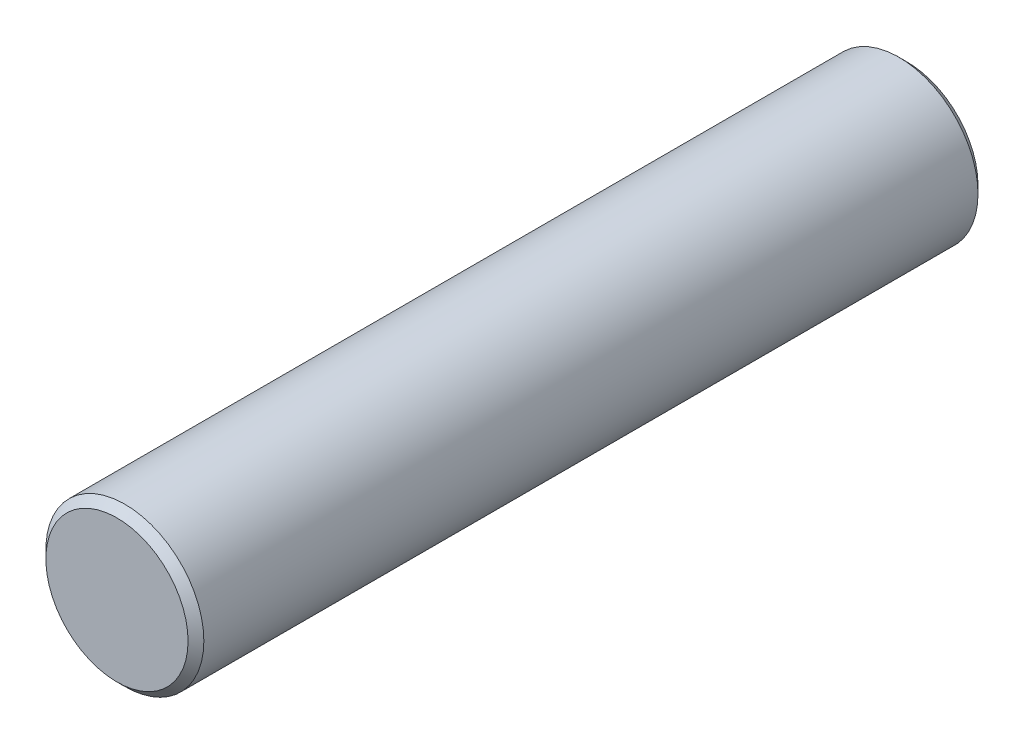
ISO-10303-21;
HEADER;
FILE_DESCRIPTION(('STEP AP214'),'2;1');
FILE_NAME('part.step','',(''),(''),'','','');
FILE_SCHEMA(('AUTOMOTIVE_DESIGN { 1 0 10303 214 1 1 1 1 }'));
ENDSEC;
DATA;
#1=APPLICATION_CONTEXT('core data for automotive mechanical design processes');
#2=APPLICATION_PROTOCOL_DEFINITION('international standard','automotive_design',2000,#1);
#3=PRODUCT_CONTEXT('',#1,'mechanical');
#4=PRODUCT('Part','Part','',(#3));
#5=PRODUCT_RELATED_PRODUCT_CATEGORY('part','',(#4));
#6=PRODUCT_DEFINITION_FORMATION('','',#4);
#7=PRODUCT_DEFINITION_CONTEXT('part definition',#1,'design');
#8=PRODUCT_DEFINITION('design','',#6,#7);
#9=PRODUCT_DEFINITION_SHAPE('','',#8);
#10=(LENGTH_UNIT() NAMED_UNIT(*) SI_UNIT(.MILLI.,.METRE.));
#11=(NAMED_UNIT(*) PLANE_ANGLE_UNIT() SI_UNIT($,.RADIAN.));
#12=(NAMED_UNIT(*) SI_UNIT($,.STERADIAN.) SOLID_ANGLE_UNIT());
#13=UNCERTAINTY_MEASURE_WITH_UNIT(LENGTH_MEASURE(1.E-05),#10,'distance_accuracy_value','');
#14=(GEOMETRIC_REPRESENTATION_CONTEXT(3) GLOBAL_UNCERTAINTY_ASSIGNED_CONTEXT((#13)) GLOBAL_UNIT_ASSIGNED_CONTEXT((#10,
#11,#12)) REPRESENTATION_CONTEXT('',''));
#15=CARTESIAN_POINT('',(0.,0.,0.));
#16=DIRECTION('',(0.,0.,1.));
#17=DIRECTION('',(1.,0.,0.));
#18=AXIS2_PLACEMENT_3D('',#15,#16,#17);
#19=CARTESIAN_POINT('',(0.,0.,25.));
#20=DIRECTION('',(0.,0.,-1.));
#21=DIRECTION('',(-1.,0.,0.));
#22=AXIS2_PLACEMENT_3D('',#19,#20,#21);
#23=CYLINDRICAL_SURFACE('',#22,2.5);
#24=CARTESIAN_POINT('',(0.,0.,0.25));
#25=DIRECTION('',(0.,0.,1.));
#26=DIRECTION('',(1.,0.,0.));
#27=AXIS2_PLACEMENT_3D('',#24,#25,#26);
#28=CIRCLE('',#27,2.5);
#29=CARTESIAN_POINT('',(2.5,0.,0.25));
#30=VERTEX_POINT('',#29);
#31=EDGE_CURVE('E39',#30,#30,#28,.T.);
#32=ORIENTED_EDGE('',*,*,#31,.T.);
#33=EDGE_LOOP('',(#32));
#34=FACE_BOUND('',#33,.T.);
#35=CARTESIAN_POINT('',(0.,0.,24.75));
#36=DIRECTION('',(0.,0.,1.));
#37=DIRECTION('',(1.,0.,0.));
#38=AXIS2_PLACEMENT_3D('',#35,#36,#37);
#39=CIRCLE('',#38,2.5);
#40=CARTESIAN_POINT('',(2.5,0.,24.75));
#41=VERTEX_POINT('',#40);
#42=EDGE_CURVE('E43',#41,#41,#39,.F.);
#43=ORIENTED_EDGE('',*,*,#42,.T.);
#44=EDGE_LOOP('',(#43));
#45=FACE_BOUND('',#44,.T.);
#46=ADVANCED_FACE('F29',(#34,#45),#23,.T.);
#47=CARTESIAN_POINT('',(0.,0.,25.));
#48=DIRECTION('',(0.,0.,1.));
#49=DIRECTION('',(1.,0.,0.));
#50=AXIS2_PLACEMENT_3D('',#47,#48,#49);
#51=PLANE('',#50);
#52=CARTESIAN_POINT('',(0.,0.,25.));
#53=DIRECTION('',(0.,0.,1.));
#54=DIRECTION('',(1.,0.,0.));
#55=AXIS2_PLACEMENT_3D('',#52,#53,#54);
#56=CIRCLE('',#55,2.25);
#57=CARTESIAN_POINT('',(2.25,0.,25.));
#58=VERTEX_POINT('',#57);
#59=EDGE_CURVE('E10',#58,#58,#56,.T.);
#60=ORIENTED_EDGE('',*,*,#59,.T.);
#61=EDGE_LOOP('',(#60));
#62=FACE_BOUND('',#61,.T.);
#63=ADVANCED_FACE('F62',(#62),#51,.T.);
#64=CARTESIAN_POINT('',(0.,0.,0.));
#65=DIRECTION('',(0.,0.,1.));
#66=DIRECTION('',(1.,0.,0.));
#67=AXIS2_PLACEMENT_3D('',#64,#65,#66);
#68=PLANE('',#67);
#69=CARTESIAN_POINT('',(0.,0.,0.));
#70=DIRECTION('',(0.,0.,1.));
#71=DIRECTION('',(1.,0.,0.));
#72=AXIS2_PLACEMENT_3D('',#69,#70,#71);
#73=CIRCLE('',#72,2.25);
#74=CARTESIAN_POINT('',(2.25,0.,0.));
#75=VERTEX_POINT('',#74);
#76=EDGE_CURVE('E35',#75,#75,#73,.F.);
#77=ORIENTED_EDGE('',*,*,#76,.T.);
#78=EDGE_LOOP('',(#77));
#79=FACE_BOUND('',#78,.T.);
#80=ADVANCED_FACE('F58',(#79),#68,.F.);
#81=CARTESIAN_POINT('',(0.,0.,0.25));
#82=DIRECTION('',(0.,0.,1.));
#83=DIRECTION('',(1.,0.,0.));
#84=AXIS2_PLACEMENT_3D('',#81,#82,#83);
#85=CONICAL_SURFACE('',#84,2.5,0.785398163397457);
#86=ORIENTED_EDGE('',*,*,#76,.F.);
#87=EDGE_LOOP('',(#86));
#88=FACE_BOUND('',#87,.T.);
#89=ORIENTED_EDGE('',*,*,#31,.F.);
#90=EDGE_LOOP('',(#89));
#91=FACE_BOUND('',#90,.T.);
#92=ADVANCED_FACE('F53',(#88,#91),#85,.T.);
#93=CARTESIAN_POINT('',(0.,0.,25.));
#94=DIRECTION('',(0.,0.,-1.));
#95=DIRECTION('',(-1.,0.,0.));
#96=AXIS2_PLACEMENT_3D('',#93,#94,#95);
#97=CONICAL_SURFACE('',#96,2.25,0.785398163397457);
#98=ORIENTED_EDGE('',*,*,#42,.F.);
#99=EDGE_LOOP('',(#98));
#100=FACE_BOUND('',#99,.T.);
#101=ORIENTED_EDGE('',*,*,#59,.F.);
#102=EDGE_LOOP('',(#101));
#103=FACE_BOUND('',#102,.T.);
#104=ADVANCED_FACE('F50',(#100,#103),#97,.T.);
#105=CLOSED_SHELL('',(#46,#63,#80,#92,#104));
#106=MANIFOLD_SOLID_BREP('B2',#105);
#107=ADVANCED_BREP_SHAPE_REPRESENTATION('',(#18,#106),#14);
#108=SHAPE_DEFINITION_REPRESENTATION(#9,#107);
ENDSEC;
END-ISO-10303-21;
